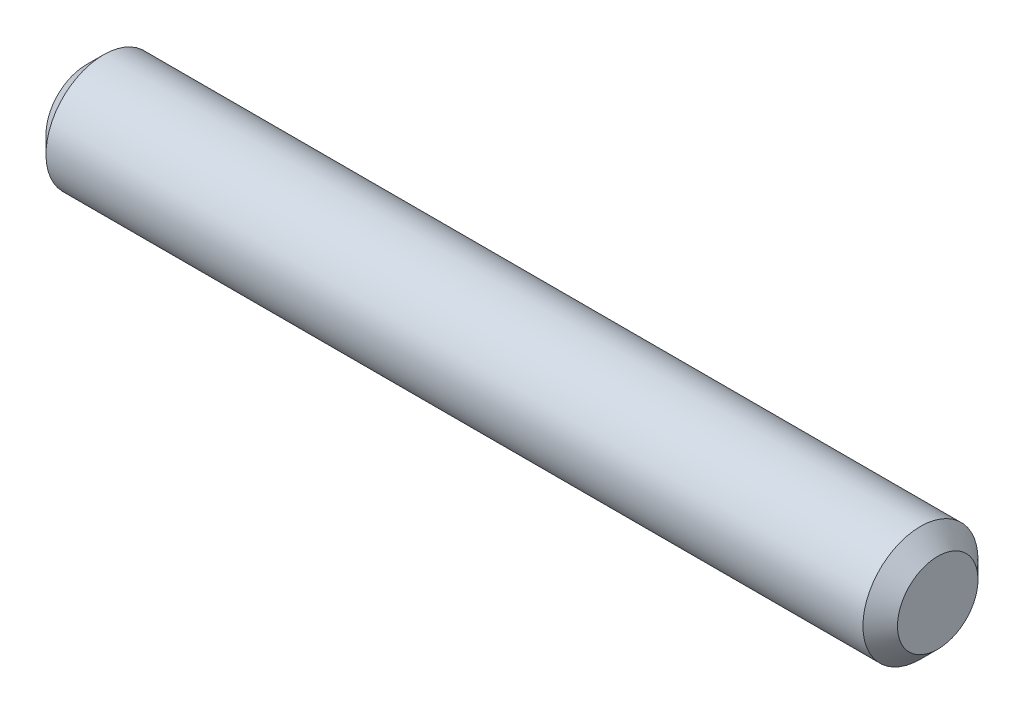
ISO-10303-21;
HEADER;
FILE_DESCRIPTION(('STEP AP214'),'2;1');
FILE_NAME('part.step','',(''),(''),'','','');
FILE_SCHEMA(('AUTOMOTIVE_DESIGN { 1 0 10303 214 1 1 1 1 }'));
ENDSEC;
DATA;
#1=APPLICATION_CONTEXT('core data for automotive mechanical design processes');
#2=APPLICATION_PROTOCOL_DEFINITION('international standard','automotive_design',2000,#1);
#3=PRODUCT_CONTEXT('',#1,'mechanical');
#4=PRODUCT('Part','Part','',(#3));
#5=PRODUCT_RELATED_PRODUCT_CATEGORY('part','',(#4));
#6=PRODUCT_DEFINITION_FORMATION('','',#4);
#7=PRODUCT_DEFINITION_CONTEXT('part definition',#1,'design');
#8=PRODUCT_DEFINITION('design','',#6,#7);
#9=PRODUCT_DEFINITION_SHAPE('','',#8);
#10=(LENGTH_UNIT() NAMED_UNIT(*) SI_UNIT(.MILLI.,.METRE.));
#11=(NAMED_UNIT(*) PLANE_ANGLE_UNIT() SI_UNIT($,.RADIAN.));
#12=(NAMED_UNIT(*) SI_UNIT($,.STERADIAN.) SOLID_ANGLE_UNIT());
#13=UNCERTAINTY_MEASURE_WITH_UNIT(LENGTH_MEASURE(1.E-05),#10,'distance_accuracy_value','');
#14=(GEOMETRIC_REPRESENTATION_CONTEXT(3) GLOBAL_UNCERTAINTY_ASSIGNED_CONTEXT((#13)) GLOBAL_UNIT_ASSIGNED_CONTEXT((#10,
#11,#12)) REPRESENTATION_CONTEXT('',''));
#15=CARTESIAN_POINT('',(0.,0.,0.));
#16=DIRECTION('',(0.,0.,1.));
#17=DIRECTION('',(1.,0.,0.));
#18=AXIS2_PLACEMENT_3D('',#15,#16,#17);
#19=CARTESIAN_POINT('',(7.4,0.,0.));
#20=DIRECTION('',(1.,0.,0.));
#21=DIRECTION('',(0.,1.,0.));
#22=AXIS2_PLACEMENT_3D('',#19,#20,#21);
#23=PLANE('',#22);
#24=CARTESIAN_POINT('',(7.40000000013197,0.,0.));
#25=DIRECTION('',(-1.,0.,0.));
#26=DIRECTION('',(0.,-1.,0.));
#27=AXIS2_PLACEMENT_3D('',#24,#25,#26);
#28=CIRCLE('',#27,0.699994293256623);
#29=CARTESIAN_POINT('',(7.40000000013197,-0.699994293256624,0.));
#30=VERTEX_POINT('',#29);
#31=EDGE_CURVE('E18',#30,#30,#28,.T.);
#32=ORIENTED_EDGE('',*,*,#31,.F.);
#33=EDGE_LOOP('',(#32));
#34=FACE_BOUND('',#33,.T.);
#35=ADVANCED_FACE('F15',(#34),#23,.T.);
#36=CARTESIAN_POINT('',(-7.4,0.,0.));
#37=DIRECTION('',(1.,0.,0.));
#38=DIRECTION('',(0.,1.,0.));
#39=AXIS2_PLACEMENT_3D('',#36,#37,#38);
#40=PLANE('',#39);
#41=CARTESIAN_POINT('',(-7.40000000013197,0.,0.));
#42=DIRECTION('',(1.,0.,0.));
#43=DIRECTION('',(0.,1.,0.));
#44=AXIS2_PLACEMENT_3D('',#41,#42,#43);
#45=CIRCLE('',#44,0.699994293256623);
#46=CARTESIAN_POINT('',(-7.40000000013197,0.699994293256624,0.));
#47=VERTEX_POINT('',#46);
#48=EDGE_CURVE('E27',#47,#47,#45,.T.);
#49=ORIENTED_EDGE('',*,*,#48,.F.);
#50=EDGE_LOOP('',(#49));
#51=FACE_BOUND('',#50,.T.);
#52=ADVANCED_FACE('F38',(#51),#40,.F.);
#53=CARTESIAN_POINT('',(7.09999184755361,0.,0.));
#54=DIRECTION('',(-1.,0.,0.));
#55=DIRECTION('',(0.,-1.,0.));
#56=AXIS2_PLACEMENT_3D('',#53,#54,#55);
#57=CONICAL_SURFACE('',#56,1.00000000009004,0.785394087250036);
#58=CARTESIAN_POINT('',(7.0999918476715,0.,0.));
#59=DIRECTION('',(1.,0.,0.));
#60=DIRECTION('',(0.,1.,0.));
#61=AXIS2_PLACEMENT_3D('',#58,#59,#60);
#62=CIRCLE('',#61,1.);
#63=CARTESIAN_POINT('',(7.0999918476715,0.999999999999999,0.));
#64=VERTEX_POINT('',#63);
#65=EDGE_CURVE('E22',#64,#64,#62,.F.);
#66=ORIENTED_EDGE('',*,*,#65,.F.);
#67=EDGE_LOOP('',(#66));
#68=FACE_BOUND('',#67,.T.);
#69=ORIENTED_EDGE('',*,*,#31,.T.);
#70=EDGE_LOOP('',(#69));
#71=FACE_BOUND('',#70,.T.);
#72=ADVANCED_FACE('F35',(#68,#71),#57,.T.);
#73=CARTESIAN_POINT('',(-7.09999184755361,0.,0.));
#74=DIRECTION('',(1.,0.,0.));
#75=DIRECTION('',(0.,1.,0.));
#76=AXIS2_PLACEMENT_3D('',#73,#74,#75);
#77=CONICAL_SURFACE('',#76,1.00000000009004,0.785394087250036);
#78=CARTESIAN_POINT('',(-7.0999918476715,0.,0.));
#79=DIRECTION('',(1.,0.,0.));
#80=DIRECTION('',(0.,1.,0.));
#81=AXIS2_PLACEMENT_3D('',#78,#79,#80);
#82=CIRCLE('',#81,1.);
#83=CARTESIAN_POINT('',(-7.0999918476715,1.,0.));
#84=VERTEX_POINT('',#83);
#85=EDGE_CURVE('E10',#84,#84,#82,.T.);
#86=ORIENTED_EDGE('',*,*,#85,.F.);
#87=EDGE_LOOP('',(#86));
#88=FACE_BOUND('',#87,.T.);
#89=ORIENTED_EDGE('',*,*,#48,.T.);
#90=EDGE_LOOP('',(#89));
#91=FACE_BOUND('',#90,.T.);
#92=ADVANCED_FACE('F46',(#88,#91),#77,.T.);
#93=CARTESIAN_POINT('',(-7.4,0.,0.));
#94=DIRECTION('',(1.,0.,0.));
#95=DIRECTION('',(0.,1.,0.));
#96=AXIS2_PLACEMENT_3D('',#93,#94,#95);
#97=CYLINDRICAL_SURFACE('',#96,1.);
#98=ORIENTED_EDGE('',*,*,#85,.T.);
#99=EDGE_LOOP('',(#98));
#100=FACE_BOUND('',#99,.T.);
#101=ORIENTED_EDGE('',*,*,#65,.T.);
#102=EDGE_LOOP('',(#101));
#103=FACE_BOUND('',#102,.T.);
#104=ADVANCED_FACE('F44',(#100,#103),#97,.T.);
#105=CLOSED_SHELL('',(#35,#52,#72,#92,#104));
#106=MANIFOLD_SOLID_BREP('B1',#105);
#107=ADVANCED_BREP_SHAPE_REPRESENTATION('',(#18,#106),#14);
#108=SHAPE_DEFINITION_REPRESENTATION(#9,#107);
ENDSEC;
END-ISO-10303-21;
